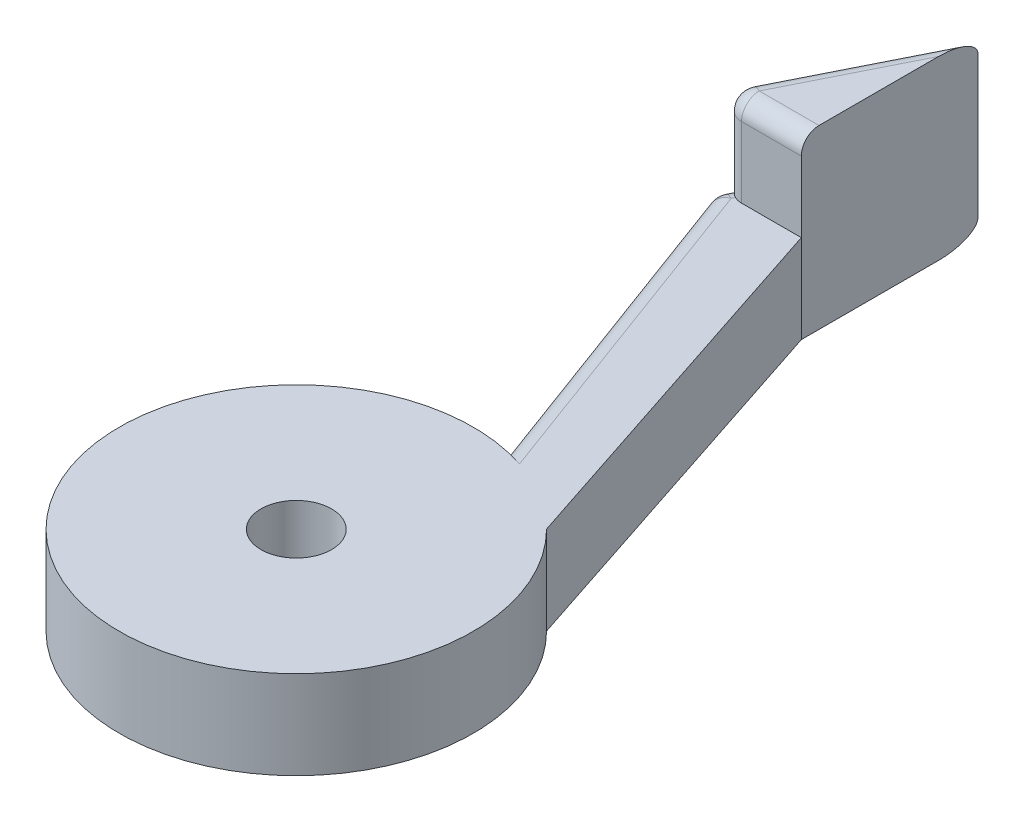
ISO-10303-21;
HEADER;
FILE_DESCRIPTION(('STEP AP214'),'2;1');
FILE_NAME('part.step','',(''),(''),'','','');
FILE_SCHEMA(('AUTOMOTIVE_DESIGN { 1 0 10303 214 1 1 1 1 }'));
ENDSEC;
DATA;
#1=APPLICATION_CONTEXT('core data for automotive mechanical design processes');
#2=APPLICATION_PROTOCOL_DEFINITION('international standard','automotive_design',2000,#1);
#3=PRODUCT_CONTEXT('',#1,'mechanical');
#4=PRODUCT('Part','Part','',(#3));
#5=PRODUCT_RELATED_PRODUCT_CATEGORY('part','',(#4));
#6=PRODUCT_DEFINITION_FORMATION('','',#4);
#7=PRODUCT_DEFINITION_CONTEXT('part definition',#1,'design');
#8=PRODUCT_DEFINITION('design','',#6,#7);
#9=PRODUCT_DEFINITION_SHAPE('','',#8);
#10=(LENGTH_UNIT() NAMED_UNIT(*) SI_UNIT(.MILLI.,.METRE.));
#11=(NAMED_UNIT(*) PLANE_ANGLE_UNIT() SI_UNIT($,.RADIAN.));
#12=(NAMED_UNIT(*) SI_UNIT($,.STERADIAN.) SOLID_ANGLE_UNIT());
#13=UNCERTAINTY_MEASURE_WITH_UNIT(LENGTH_MEASURE(1.E-05),#10,'distance_accuracy_value','');
#14=(GEOMETRIC_REPRESENTATION_CONTEXT(3) GLOBAL_UNCERTAINTY_ASSIGNED_CONTEXT((#13)) GLOBAL_UNIT_ASSIGNED_CONTEXT((#10,
#11,#12)) REPRESENTATION_CONTEXT('',''));
#15=CARTESIAN_POINT('',(0.,0.,0.));
#16=DIRECTION('',(0.,0.,1.));
#17=DIRECTION('',(1.,0.,0.));
#18=AXIS2_PLACEMENT_3D('',#15,#16,#17);
#19=CARTESIAN_POINT('',(-2.19919484502613,2.5,0.813344420387716));
#20=DIRECTION('',(0.937911476638627,0.,-0.346874706471299));
#21=DIRECTION('',(-0.346874706471299,0.,-0.937911476638627));
#22=AXIS2_PLACEMENT_3D('',#19,#20,#21);
#23=PLANE('',#22);
#24=DIRECTION('',(0.346874706471299,0.,0.937911476638627));
#25=VECTOR('',#24,1.);
#26=CARTESIAN_POINT('',(-2.5,2.,0.));
#27=LINE('',#26,#25);
#28=CARTESIAN_POINT('',(0.96874706471299,2.,9.37911476638627));
#29=VERTEX_POINT('',#28);
#30=CARTESIAN_POINT('',(-2.42483672600394,2.,0.203233317354803));
#31=VERTEX_POINT('',#30);
#32=EDGE_CURVE('E201',#29,#31,#27,.F.);
#33=ORIENTED_EDGE('',*,*,#32,.T.);
#34=DIRECTION('',(0.,-1.,0.));
#35=VECTOR('',#34,1.);
#36=CARTESIAN_POINT('',(-2.42483672600394,0.5,0.203233317354803));
#37=LINE('',#36,#35);
#38=CARTESIAN_POINT('',(-2.42483672600394,0.5,0.203233317354803));
#39=VERTEX_POINT('',#38);
#40=EDGE_CURVE('E297',#31,#39,#37,.T.);
#41=ORIENTED_EDGE('',*,*,#40,.T.);
#42=DIRECTION('',(0.346874706471299,0.,0.937911476638627));
#43=VECTOR('',#42,1.);
#44=CARTESIAN_POINT('',(-2.19919484502613,0.5,0.813344420387716));
#45=LINE('',#44,#43);
#46=CARTESIAN_POINT('',(0.96874706471299,0.5,9.37911476638627));
#47=VERTEX_POINT('',#46);
#48=EDGE_CURVE('E199',#39,#47,#45,.T.);
#49=ORIENTED_EDGE('',*,*,#48,.T.);
#50=DIRECTION('',(0.,-1.,0.));
#51=VECTOR('',#50,1.);
#52=CARTESIAN_POINT('',(0.96874706471299,2.5,9.37911476638627));
#53=LINE('',#52,#51);
#54=EDGE_CURVE('E172',#29,#47,#53,.T.);
#55=ORIENTED_EDGE('',*,*,#54,.F.);
#56=EDGE_LOOP('',(#33,#41,#49,#55));
#57=FACE_BOUND('',#56,.T.);
#58=ADVANCED_FACE('F39',(#57),#23,.F.);
#59=CARTESIAN_POINT('',(0.,2.5,14.2927927525466));
#60=DIRECTION('',(0.,-1.,0.));
#61=DIRECTION('',(0.,0.,-1.));
#62=AXIS2_PLACEMENT_3D('',#59,#60,#61);
#63=CYLINDRICAL_SURFACE('',#62,5.00826339433802);
#64=CARTESIAN_POINT('',(0.,0.,14.2927927525466));
#65=DIRECTION('',(0.,1.,0.));
#66=DIRECTION('',(0.,0.,1.));
#67=AXIS2_PLACEMENT_3D('',#64,#65,#66);
#68=CIRCLE('',#67,5.00826339433802);
#69=CARTESIAN_POINT('',(1.55887625665001,0.,9.53331725166213));
#70=VERTEX_POINT('',#69);
#71=CARTESIAN_POINT('',(3.53696271503135,0.,10.7470069468972));
#72=VERTEX_POINT('',#71);
#73=EDGE_CURVE('E331',#70,#72,#68,.T.);
#74=ORIENTED_EDGE('',*,*,#73,.T.);
#75=DIRECTION('',(0.,-1.,0.));
#76=VECTOR('',#75,1.);
#77=CARTESIAN_POINT('',(3.53696271503135,2.5,10.7470069468972));
#78=LINE('',#77,#76);
#79=CARTESIAN_POINT('',(3.53696271503135,2.5,10.7470069468972));
#80=VERTEX_POINT('',#79);
#81=EDGE_CURVE('E170',#80,#72,#78,.T.);
#82=ORIENTED_EDGE('',*,*,#81,.F.);
#83=CARTESIAN_POINT('',(0.,2.5,14.2927927525466));
#84=DIRECTION('',(0.,1.,0.));
#85=DIRECTION('',(0.,0.,1.));
#86=AXIS2_PLACEMENT_3D('',#83,#84,#85);
#87=CIRCLE('',#86,5.00826339433802);
#88=CARTESIAN_POINT('',(1.55887625665001,2.5,9.53331725166213));
#89=VERTEX_POINT('',#88);
#90=EDGE_CURVE('E163',#89,#80,#87,.T.);
#91=ORIENTED_EDGE('',*,*,#90,.F.);
#92=CARTESIAN_POINT('',(1.55887625665001,2.5,9.53331725166213));
#93=CARTESIAN_POINT('',(1.51874915220368,2.50000491035967,9.52014688337141));
#94=CARTESIAN_POINT('',(1.47830324113876,2.49671259069117,9.50748829312047));
#95=CARTESIAN_POINT('',(1.39796524720947,2.48303797539291,9.4834170384644));
#96=CARTESIAN_POINT('',(1.35807865353081,2.47260856343887,9.47201324206123));
#97=CARTESIAN_POINT('',(1.28900253844985,2.44722979943888,9.45314596119411));
#98=CARTESIAN_POINT('',(1.25936554359134,2.43374630756178,9.44536374922276));
#99=CARTESIAN_POINT('',(1.20254098701441,2.40200353236649,9.43095684109237));
#100=CARTESIAN_POINT('',(1.1753461312988,2.38375915262343,9.42432863848792));
#101=CARTESIAN_POINT('',(1.12829992101739,2.34564387241397,9.4132294732132));
#102=CARTESIAN_POINT('',(1.10795914608467,2.32642935430009,9.4085840143167));
#103=CARTESIAN_POINT('',(1.07059323278837,2.28478539561264,9.40025773628084));
#104=CARTESIAN_POINT('',(1.05356920894367,2.26235487875574,9.39657724125255));
#105=CARTESIAN_POINT('',(1.0235709752695,2.21459048504414,9.39021764507806));
#106=CARTESIAN_POINT('',(1.01062252498672,2.18923947186843,9.38754489314206));
#107=CARTESIAN_POINT('',(0.98967847754528,2.13649780798282,9.3832759790104));
#108=CARTESIAN_POINT('',(0.98167405679979,2.10911088922022,9.38167789839861));
#109=CARTESIAN_POINT('',(0.973850202143294,2.06783919494106,9.38012302562548));
#110=CARTESIAN_POINT('',(0.971938972317017,2.05433892817381,9.37974488474474));
#111=CARTESIAN_POINT('',(0.969387665779037,2.02722868792913,9.37924101432628));
#112=CARTESIAN_POINT('',(0.968746244888863,2.01361884579003,9.37911501787512));
#113=CARTESIAN_POINT('',(0.968747064712989,2.,9.37911476638627));
#114=B_SPLINE_CURVE_WITH_KNOTS('',3,(#92,#93,#94,#95,#96,#97,#98,#99,#100,#101,#102,#103,#104,
#105,#106,#107,#108,#109,#110,#111,#112,#113),.UNSPECIFIED.,.F.,.F.,(4,2,2,2,2,2,2,2,2,2,4),(0.,
0.126803701271093,0.254452691142103,0.354487672778958,0.454213183214775,0.538953117732193,
0.623721478253533,0.709015328927398,0.794156512859183,0.835023142166766,0.875846488207517),.UNSPECIFIED.);
#115=EDGE_CURVE('E204',#89,#29,#114,.T.);
#116=ORIENTED_EDGE('',*,*,#115,.T.);
#117=ORIENTED_EDGE('',*,*,#54,.T.);
#118=CARTESIAN_POINT('',(0.96874706471299,0.5,9.37911476638627));
#119=CARTESIAN_POINT('',(0.968710230051385,0.474989795484606,9.37911305088923));
#120=CARTESIAN_POINT('',(0.970902466561813,0.4500056432001,9.37953970679768));
#121=CARTESIAN_POINT('',(0.979450683810274,0.400891966710027,9.38123377058047));
#122=CARTESIAN_POINT('',(0.985789401633862,0.376759334508423,9.38249769296485));
#123=CARTESIAN_POINT('',(1.00233468237207,0.329949241123511,9.38584932354842));
#124=CARTESIAN_POINT('',(1.01253851631272,0.30727076640842,9.38793645056492));
#125=CARTESIAN_POINT('',(1.03634822116773,0.263866074714385,9.39291182854659));
#126=CARTESIAN_POINT('',(1.04995650799676,0.243141258558408,9.39580064857997));
#127=CARTESIAN_POINT('',(1.08074272126823,0.203119149009627,9.40250075348891));
#128=CARTESIAN_POINT('',(1.09805800338941,0.183934205625374,9.40634891146972));
#129=CARTESIAN_POINT('',(1.13519202069972,0.1483840522186,9.41484192531756));
#130=CARTESIAN_POINT('',(1.15501151226218,0.132019697674217,9.41948702204491));
#131=CARTESIAN_POINT('',(1.1993710849182,0.100199436689002,9.43020101601807));
#132=CARTESIAN_POINT('',(1.22418710505081,0.0851655054017718,9.43637750407447));
#133=CARTESIAN_POINT('',(1.27552126387592,0.0588537159718972,9.44960661843922));
#134=CARTESIAN_POINT('',(1.30204086315974,0.0475791336438873,9.45666000154677));
#135=CARTESIAN_POINT('',(1.36087613424571,0.0270272084467275,9.47285457721357));
#136=CARTESIAN_POINT('',(1.39339304181379,0.018446222966681,9.48214502639475));
#137=CARTESIAN_POINT('',(1.45901410798038,0.00608366000536986,9.50163948291999));
#138=CARTESIAN_POINT('',(1.49211774445138,0.0022980131690161,9.5118427077929));
#139=CARTESIAN_POINT('',(1.53642244372996,0.000256629342131228,9.52600657570718));
#140=CARTESIAN_POINT('',(1.54765844067295,1.59562613622878E-07,9.52964252599592));
#141=CARTESIAN_POINT('',(1.55887625665001,0.,9.53331725166213));
#142=B_SPLINE_CURVE_WITH_KNOTS('',3,(#118,#119,#120,#121,#122,#123,#124,#125,#126,#127,#128,
#129,#130,#131,#132,#133,#134,#135,#136,#137,#138,#139,#140,#141),.UNSPECIFIED.,.F.,.F.,(4,2,2,
2,2,2,2,2,2,2,2,4),(0.,0.0748902378983276,0.149470655151911,0.22399851258989,0.298579408278331,
0.376654002826512,0.454752235710567,0.543409763768,0.632144345391368,0.736430704440913,
0.84062850600088,0.876051836267374),.UNSPECIFIED.);
#143=EDGE_CURVE('E212',#47,#70,#142,.T.);
#144=ORIENTED_EDGE('',*,*,#143,.T.);
#145=EDGE_LOOP('',(#74,#82,#91,#116,#117,#144));
#146=FACE_BOUND('',#145,.T.);
#147=ADVANCED_FACE('F219',(#146),#63,.T.);
#148=CARTESIAN_POINT('',(0.,2.5,0.));
#149=DIRECTION('',(0.949879525014784,0.,-0.312616199128722));
#150=DIRECTION('',(-0.312616199128722,0.,-0.949879525014784));
#151=AXIS2_PLACEMENT_3D('',#148,#149,#150);
#152=PLANE('',#151);
#153=DIRECTION('',(0.312616199128722,0.,0.949879525014784));
#154=VECTOR('',#153,1.);
#155=CARTESIAN_POINT('',(0.,0.,0.));
#156=LINE('',#155,#154);
#157=CARTESIAN_POINT('',(0.,0.,0.));
#158=VERTEX_POINT('',#157);
#159=EDGE_CURVE('E169',#158,#72,#156,.T.);
#160=ORIENTED_EDGE('',*,*,#159,.F.);
#161=DIRECTION('',(0.,-1.,0.));
#162=VECTOR('',#161,1.);
#163=CARTESIAN_POINT('',(0.,2.5,0.));
#164=LINE('',#163,#162);
#165=CARTESIAN_POINT('',(0.,2.5,0.));
#166=VERTEX_POINT('',#165);
#167=EDGE_CURVE('E146',#166,#158,#164,.T.);
#168=ORIENTED_EDGE('',*,*,#167,.F.);
#169=DIRECTION('',(0.312616199128722,0.,0.949879525014784));
#170=VECTOR('',#169,1.);
#171=CARTESIAN_POINT('',(0.,2.5,0.));
#172=LINE('',#171,#170);
#173=EDGE_CURVE('E147',#166,#80,#172,.T.);
#174=ORIENTED_EDGE('',*,*,#173,.T.);
#175=ORIENTED_EDGE('',*,*,#81,.T.);
#176=EDGE_LOOP('',(#160,#168,#174,#175));
#177=FACE_BOUND('',#176,.T.);
#178=ADVANCED_FACE('F167',(#177),#152,.T.);
#179=CARTESIAN_POINT('',(0.,2.5,14.2927927525466));
#180=DIRECTION('',(0.,-1.,0.));
#181=DIRECTION('',(0.,0.,-1.));
#182=AXIS2_PLACEMENT_3D('',#179,#180,#181);
#183=CYLINDRICAL_SURFACE('',#182,1.);
#184=CARTESIAN_POINT('',(0.,2.5,14.2927927525466));
#185=DIRECTION('',(0.,1.,0.));
#186=DIRECTION('',(0.,0.,1.));
#187=AXIS2_PLACEMENT_3D('',#184,#185,#186);
#188=CIRCLE('',#187,1.);
#189=CARTESIAN_POINT('',(0.,2.5,15.2927927525466));
#190=VERTEX_POINT('',#189);
#191=EDGE_CURVE('E326',#190,#190,#188,.T.);
#192=ORIENTED_EDGE('',*,*,#191,.T.);
#193=EDGE_LOOP('',(#192));
#194=FACE_BOUND('',#193,.T.);
#195=CARTESIAN_POINT('',(0.,0.,14.2927927525466));
#196=DIRECTION('',(0.,1.,0.));
#197=DIRECTION('',(0.,0.,1.));
#198=AXIS2_PLACEMENT_3D('',#195,#196,#197);
#199=CIRCLE('',#198,1.);
#200=CARTESIAN_POINT('',(0.,0.,15.2927927525466));
#201=VERTEX_POINT('',#200);
#202=EDGE_CURVE('E157',#201,#201,#199,.T.);
#203=ORIENTED_EDGE('',*,*,#202,.F.);
#204=EDGE_LOOP('',(#203));
#205=FACE_BOUND('',#204,.T.);
#206=ADVANCED_FACE('F265',(#194,#205),#183,.F.);
#207=CARTESIAN_POINT('',(0.,2.5,0.));
#208=DIRECTION('',(0.,1.,0.));
#209=DIRECTION('',(0.,0.,1.));
#210=AXIS2_PLACEMENT_3D('',#207,#208,#209);
#211=PLANE('',#210);
#212=ORIENTED_EDGE('',*,*,#191,.F.);
#213=EDGE_LOOP('',(#212));
#214=FACE_BOUND('',#213,.T.);
#215=DIRECTION('',(1.,0.,0.));
#216=VECTOR('',#215,1.);
#217=CARTESIAN_POINT('',(0.,2.5,0.));
#218=LINE('',#217,#216);
#219=CARTESIAN_POINT('',(-1.69098300562505,2.5,0.));
#220=VERTEX_POINT('',#219);
#221=EDGE_CURVE('E136',#220,#166,#218,.T.);
#222=ORIENTED_EDGE('',*,*,#221,.F.);
#223=CARTESIAN_POINT('',(-1.69098300562505,2.5,-0.5));
#224=DIRECTION('',(0.,1.,0.));
#225=DIRECTION('',(0.,0.,1.));
#226=AXIS2_PLACEMENT_3D('',#223,#224,#225);
#227=CIRCLE('',#226,0.5);
#228=CARTESIAN_POINT('',(-1.91458980337503,2.5,-0.0527864045000418));
#229=VERTEX_POINT('',#228);
#230=EDGE_CURVE('E11',#220,#229,#227,.F.);
#231=ORIENTED_EDGE('',*,*,#230,.T.);
#232=DIRECTION('',(-0.447213595499958,0.,0.894427190999916));
#233=VECTOR('',#232,1.);
#234=CARTESIAN_POINT('',(-1.55278640450004,2.5,-0.776393202250021));
#235=LINE('',#234,#233);
#236=CARTESIAN_POINT('',(-1.95588098768463,2.5,0.0297959641191552));
#237=VERTEX_POINT('',#236);
#238=EDGE_CURVE('E56',#229,#237,#235,.T.);
#239=ORIENTED_EDGE('',*,*,#238,.T.);
#240=DIRECTION('',(0.346874706471299,0.,0.937911476638627));
#241=VECTOR('',#240,1.);
#242=CARTESIAN_POINT('',(1.4377028030323,2.5,9.20567741315062));
#243=LINE('',#242,#241);
#244=EDGE_CURVE('E197',#237,#89,#243,.T.);
#245=ORIENTED_EDGE('',*,*,#244,.T.);
#246=ORIENTED_EDGE('',*,*,#90,.T.);
#247=ORIENTED_EDGE('',*,*,#173,.F.);
#248=EDGE_LOOP('',(#222,#231,#239,#245,#246,#247));
#249=FACE_BOUND('',#248,.T.);
#250=ADVANCED_FACE('F161',(#214,#249),#211,.T.);
#251=CARTESIAN_POINT('',(0.,0.,0.));
#252=DIRECTION('',(0.,1.,0.));
#253=DIRECTION('',(0.,0.,1.));
#254=AXIS2_PLACEMENT_3D('',#251,#252,#253);
#255=PLANE('',#254);
#256=ORIENTED_EDGE('',*,*,#202,.T.);
#257=EDGE_LOOP('',(#256));
#258=FACE_BOUND('',#257,.T.);
#259=DIRECTION('',(0.346874706471299,0.,0.937911476638627));
#260=VECTOR('',#259,1.);
#261=CARTESIAN_POINT('',(-1.73023910670681,0.,0.639907067152066));
#262=LINE('',#261,#260);
#263=CARTESIAN_POINT('',(-1.95588098768463,0.,0.0297959641191532));
#264=VERTEX_POINT('',#263);
#265=EDGE_CURVE('E191',#70,#264,#262,.F.);
#266=ORIENTED_EDGE('',*,*,#265,.T.);
#267=DIRECTION('',(0.447213595499958,0.,-0.894427190999916));
#268=VECTOR('',#267,1.);
#269=CARTESIAN_POINT('',(0.447213595499958,0.,-4.77639320225002));
#270=LINE('',#269,#268);
#271=CARTESIAN_POINT('',(0.,0.,-3.8819660112501));
#272=VERTEX_POINT('',#271);
#273=EDGE_CURVE('E194',#264,#272,#270,.T.);
#274=ORIENTED_EDGE('',*,*,#273,.T.);
#275=DIRECTION('',(0.,0.,-1.));
#276=VECTOR('',#275,1.);
#277=CARTESIAN_POINT('',(0.,0.,0.));
#278=LINE('',#277,#276);
#279=EDGE_CURVE('E318',#158,#272,#278,.T.);
#280=ORIENTED_EDGE('',*,*,#279,.F.);
#281=ORIENTED_EDGE('',*,*,#159,.T.);
#282=ORIENTED_EDGE('',*,*,#73,.F.);
#283=EDGE_LOOP('',(#266,#274,#280,#281,#282));
#284=FACE_BOUND('',#283,.T.);
#285=ADVANCED_FACE('F334',(#258,#284),#255,.F.);
#286=CARTESIAN_POINT('',(0.,5.,0.));
#287=DIRECTION('',(0.,0.,-1.));
#288=DIRECTION('',(-1.,0.,0.));
#289=AXIS2_PLACEMENT_3D('',#286,#287,#288);
#290=PLANE('',#289);
#291=DIRECTION('',(0.,-1.,0.));
#292=VECTOR('',#291,1.);
#293=CARTESIAN_POINT('',(0.,5.,0.));
#294=LINE('',#293,#292);
#295=CARTESIAN_POINT('',(0.,4.5,0.));
#296=VERTEX_POINT('',#295);
#297=EDGE_CURVE('E139',#296,#166,#294,.T.);
#298=ORIENTED_EDGE('',*,*,#297,.F.);
#299=DIRECTION('',(1.,0.,0.));
#300=VECTOR('',#299,1.);
#301=CARTESIAN_POINT('',(-1.94098300562505,4.5,0.));
#302=LINE('',#301,#300);
#303=CARTESIAN_POINT('',(-1.69098300562505,4.5,0.));
#304=VERTEX_POINT('',#303);
#305=EDGE_CURVE('E290',#296,#304,#302,.F.);
#306=ORIENTED_EDGE('',*,*,#305,.T.);
#307=DIRECTION('',(0.,-1.,0.));
#308=VECTOR('',#307,1.);
#309=CARTESIAN_POINT('',(-1.69098300562505,2.,0.));
#310=LINE('',#309,#308);
#311=EDGE_CURVE('E142',#304,#220,#310,.T.);
#312=ORIENTED_EDGE('',*,*,#311,.T.);
#313=ORIENTED_EDGE('',*,*,#221,.T.);
#314=EDGE_LOOP('',(#298,#306,#312,#313));
#315=FACE_BOUND('',#314,.T.);
#316=ADVANCED_FACE('F138',(#315),#290,.F.);
#317=CARTESIAN_POINT('',(-2.,5.,-1.));
#318=DIRECTION('',(-0.894427190999916,0.,-0.447213595499958));
#319=DIRECTION('',(-0.447213595499958,0.,0.894427190999916));
#320=AXIS2_PLACEMENT_3D('',#317,#318,#319);
#321=PLANE('',#320);
#322=DIRECTION('',(0.447213595499958,0.,-0.894427190999916));
#323=VECTOR('',#322,1.);
#324=CARTESIAN_POINT('',(-2.5,0.5,0.));
#325=LINE('',#324,#323);
#326=CARTESIAN_POINT('',(0.,0.5,-5.));
#327=VERTEX_POINT('',#326);
#328=CARTESIAN_POINT('',(-2.40309458318459,0.5,-0.193810833630826));
#329=VERTEX_POINT('',#328);
#330=EDGE_CURVE('E179',#327,#329,#325,.F.);
#331=ORIENTED_EDGE('',*,*,#330,.T.);
#332=DIRECTION('',(0.,-1.,0.));
#333=VECTOR('',#332,1.);
#334=CARTESIAN_POINT('',(-2.40309458318459,2.,-0.193810833630826));
#335=LINE('',#334,#333);
#336=CARTESIAN_POINT('',(-2.40309458318459,2.,-0.193810833630826));
#337=VERTEX_POINT('',#336);
#338=EDGE_CURVE('E48',#329,#337,#335,.F.);
#339=ORIENTED_EDGE('',*,*,#338,.T.);
#340=DIRECTION('',(-0.447213595499958,0.,0.894427190999916));
#341=VECTOR('',#340,1.);
#342=CARTESIAN_POINT('',(-2.,2.,-1.));
#343=LINE('',#342,#341);
#344=CARTESIAN_POINT('',(-2.13819660112501,2.,-0.723606797749979));
#345=VERTEX_POINT('',#344);
#346=EDGE_CURVE('E301',#337,#345,#343,.F.);
#347=ORIENTED_EDGE('',*,*,#346,.T.);
#348=DIRECTION('',(0.,-1.,0.));
#349=VECTOR('',#348,1.);
#350=CARTESIAN_POINT('',(-2.13819660112501,4.5,-0.723606797749979));
#351=LINE('',#350,#349);
#352=CARTESIAN_POINT('',(-2.13819660112501,4.5,-0.723606797749979));
#353=VERTEX_POINT('',#352);
#354=EDGE_CURVE('E299',#345,#353,#351,.F.);
#355=ORIENTED_EDGE('',*,*,#354,.T.);
#356=DIRECTION('',(0.447213595499958,0.,-0.894427190999916));
#357=VECTOR('',#356,1.);
#358=CARTESIAN_POINT('',(-2.,4.5,-1.));
#359=LINE('',#358,#357);
#360=CARTESIAN_POINT('',(0.,4.5,-5.));
#361=VERTEX_POINT('',#360);
#362=EDGE_CURVE('E181',#353,#361,#359,.T.);
#363=ORIENTED_EDGE('',*,*,#362,.T.);
#364=DIRECTION('',(0.,-1.,0.));
#365=VECTOR('',#364,1.);
#366=CARTESIAN_POINT('',(0.,5.,-5.));
#367=LINE('',#366,#365);
#368=EDGE_CURVE('E158',#361,#327,#367,.T.);
#369=ORIENTED_EDGE('',*,*,#368,.T.);
#370=EDGE_LOOP('',(#331,#339,#347,#355,#363,#369));
#371=FACE_BOUND('',#370,.T.);
#372=ADVANCED_FACE('F343',(#371),#321,.T.);
#373=CARTESIAN_POINT('',(0.,5.,0.));
#374=DIRECTION('',(-1.,0.,0.));
#375=DIRECTION('',(0.,0.,1.));
#376=AXIS2_PLACEMENT_3D('',#373,#374,#375);
#377=PLANE('',#376);
#378=DIRECTION('',(0.,0.,-1.));
#379=VECTOR('',#378,1.);
#380=CARTESIAN_POINT('',(0.,5.,0.));
#381=LINE('',#380,#379);
#382=CARTESIAN_POINT('',(0.,5.,-0.5));
#383=VERTEX_POINT('',#382);
#384=CARTESIAN_POINT('',(0.,5.,-3.88196601125011));
#385=VERTEX_POINT('',#384);
#386=EDGE_CURVE('E320',#383,#385,#381,.T.);
#387=ORIENTED_EDGE('',*,*,#386,.F.);
#388=CARTESIAN_POINT('',(0.,4.5,-0.5));
#389=DIRECTION('',(-1.,0.,0.));
#390=DIRECTION('',(0.,0.,1.));
#391=AXIS2_PLACEMENT_3D('',#388,#389,#390);
#392=CIRCLE('',#391,0.5);
#393=EDGE_CURVE('E156',#383,#296,#392,.F.);
#394=ORIENTED_EDGE('',*,*,#393,.T.);
#395=ORIENTED_EDGE('',*,*,#297,.T.);
#396=ORIENTED_EDGE('',*,*,#167,.T.);
#397=ORIENTED_EDGE('',*,*,#279,.T.);
#398=CARTESIAN_POINT('',(0.,0.5,-3.8819660112501));
#399=DIRECTION('',(-1.,0.,0.));
#400=DIRECTION('',(0.,0.,1.));
#401=AXIS2_PLACEMENT_3D('',#398,#399,#400);
#402=ELLIPSE('',#401,1.11803398874989,0.5);
#403=EDGE_CURVE('E183',#272,#327,#402,.F.);
#404=ORIENTED_EDGE('',*,*,#403,.T.);
#405=ORIENTED_EDGE('',*,*,#368,.F.);
#406=CARTESIAN_POINT('',(0.,4.5,-3.88196601125011));
#407=DIRECTION('',(-1.,0.,0.));
#408=DIRECTION('',(0.,0.,-1.));
#409=AXIS2_PLACEMENT_3D('',#406,#407,#408);
#410=ELLIPSE('',#409,1.11803398874989,0.5);
#411=EDGE_CURVE('E185',#361,#385,#410,.F.);
#412=ORIENTED_EDGE('',*,*,#411,.T.);
#413=EDGE_LOOP('',(#387,#394,#395,#396,#397,#404,#405,#412));
#414=FACE_BOUND('',#413,.T.);
#415=ADVANCED_FACE('F152',(#414),#377,.F.);
#416=CARTESIAN_POINT('',(0.,5.,0.));
#417=DIRECTION('',(0.,1.,0.));
#418=DIRECTION('',(0.,0.,1.));
#419=AXIS2_PLACEMENT_3D('',#416,#417,#418);
#420=PLANE('',#419);
#421=DIRECTION('',(0.447213595499958,0.,-0.894427190999916));
#422=VECTOR('',#421,1.);
#423=CARTESIAN_POINT('',(-1.55278640450004,5.,-0.776393202250021));
#424=LINE('',#423,#422);
#425=CARTESIAN_POINT('',(-1.69098300562505,5.,-0.5));
#426=VERTEX_POINT('',#425);
#427=EDGE_CURVE('E188',#385,#426,#424,.F.);
#428=ORIENTED_EDGE('',*,*,#427,.T.);
#429=DIRECTION('',(1.,0.,0.));
#430=VECTOR('',#429,1.);
#431=CARTESIAN_POINT('',(0.,5.,-0.5));
#432=LINE('',#431,#430);
#433=EDGE_CURVE('E339',#426,#383,#432,.T.);
#434=ORIENTED_EDGE('',*,*,#433,.T.);
#435=ORIENTED_EDGE('',*,*,#386,.T.);
#436=EDGE_LOOP('',(#428,#434,#435));
#437=FACE_BOUND('',#436,.T.);
#438=ADVANCED_FACE('F271',(#437),#420,.T.);
#439=CARTESIAN_POINT('',(-1.55278640450004,4.5,-0.776393202250021));
#440=DIRECTION('',(0.447213595499958,0.,-0.894427190999916));
#441=DIRECTION('',(-0.894427190999916,0.,-0.447213595499958));
#442=AXIS2_PLACEMENT_3D('',#439,#440,#441);
#443=CYLINDRICAL_SURFACE('',#442,0.5);
#444=ORIENTED_EDGE('',*,*,#362,.F.);
#445=CARTESIAN_POINT('',(-1.69098300562505,4.5,-0.5));
#446=DIRECTION('',(0.447213595499958,0.,-0.894427190999916));
#447=DIRECTION('',(-0.894427190999916,0.,-0.447213595499958));
#448=AXIS2_PLACEMENT_3D('',#445,#446,#447);
#449=CIRCLE('',#448,0.5);
#450=EDGE_CURVE('E287',#353,#426,#449,.T.);
#451=ORIENTED_EDGE('',*,*,#450,.T.);
#452=ORIENTED_EDGE('',*,*,#427,.F.);
#453=ORIENTED_EDGE('',*,*,#411,.F.);
#454=EDGE_LOOP('',(#444,#451,#452,#453));
#455=FACE_BOUND('',#454,.T.);
#456=ADVANCED_FACE('F269',(#455),#443,.T.);
#457=CARTESIAN_POINT('',(-1.73023910670681,0.5,0.639907067152066));
#458=DIRECTION('',(0.346874706471299,0.,0.937911476638627));
#459=DIRECTION('',(0.937911476638627,0.,-0.346874706471299));
#460=AXIS2_PLACEMENT_3D('',#457,#458,#459);
#461=CYLINDRICAL_SURFACE('',#460,0.5);
#462=ORIENTED_EDGE('',*,*,#48,.F.);
#463=CARTESIAN_POINT('',(-1.95588098768463,0.5,0.0297959641191534));
#464=DIRECTION('',(0.346874706471299,0.,0.937911476638627));
#465=DIRECTION('',(0.937911476638627,0.,-0.346874706471299));
#466=AXIS2_PLACEMENT_3D('',#463,#464,#465);
#467=CIRCLE('',#466,0.5);
#468=EDGE_CURVE('E286',#39,#264,#467,.T.);
#469=ORIENTED_EDGE('',*,*,#468,.T.);
#470=ORIENTED_EDGE('',*,*,#265,.F.);
#471=ORIENTED_EDGE('',*,*,#143,.F.);
#472=EDGE_LOOP('',(#462,#469,#470,#471));
#473=FACE_BOUND('',#472,.T.);
#474=ADVANCED_FACE('F229',(#473),#461,.T.);
#475=CARTESIAN_POINT('',(-1.55278640450004,0.5,-0.776393202250021));
#476=DIRECTION('',(-0.447213595499958,0.,0.894427190999916));
#477=DIRECTION('',(0.894427190999916,0.,0.447213595499958));
#478=AXIS2_PLACEMENT_3D('',#475,#476,#477);
#479=CYLINDRICAL_SURFACE('',#478,0.5);
#480=ORIENTED_EDGE('',*,*,#273,.F.);
#481=CARTESIAN_POINT('',(-1.95588098768463,0.5,0.0297959641191533));
#482=DIRECTION('',(-0.447213595499958,0.,0.894427190999916));
#483=DIRECTION('',(0.894427190999916,0.,0.447213595499958));
#484=AXIS2_PLACEMENT_3D('',#481,#482,#483);
#485=CIRCLE('',#484,0.5);
#486=EDGE_CURVE('E282',#264,#329,#485,.F.);
#487=ORIENTED_EDGE('',*,*,#486,.T.);
#488=ORIENTED_EDGE('',*,*,#330,.F.);
#489=ORIENTED_EDGE('',*,*,#403,.F.);
#490=EDGE_LOOP('',(#480,#487,#488,#489));
#491=FACE_BOUND('',#490,.T.);
#492=ADVANCED_FACE('F227',(#491),#479,.T.);
#493=CARTESIAN_POINT('',(-1.73023910670681,2.,0.639907067152066));
#494=DIRECTION('',(-0.346874706471299,0.,-0.937911476638627));
#495=DIRECTION('',(-0.937911476638627,0.,0.346874706471299));
#496=AXIS2_PLACEMENT_3D('',#493,#494,#495);
#497=CYLINDRICAL_SURFACE('',#496,0.5);
#498=ORIENTED_EDGE('',*,*,#244,.F.);
#499=CARTESIAN_POINT('',(-1.95588098768463,2.,0.0297959641191531));
#500=DIRECTION('',(-0.346874706471299,0.,-0.937911476638627));
#501=DIRECTION('',(-0.937911476638627,0.,0.346874706471299));
#502=AXIS2_PLACEMENT_3D('',#499,#500,#501);
#503=CIRCLE('',#502,0.5);
#504=EDGE_CURVE('E295',#237,#31,#503,.F.);
#505=ORIENTED_EDGE('',*,*,#504,.T.);
#506=ORIENTED_EDGE('',*,*,#32,.F.);
#507=ORIENTED_EDGE('',*,*,#115,.F.);
#508=EDGE_LOOP('',(#498,#505,#506,#507));
#509=FACE_BOUND('',#508,.T.);
#510=ADVANCED_FACE('F223',(#509),#497,.T.);
#511=CARTESIAN_POINT('',(-1.95588098768463,0.5,0.0297959641191534));
#512=DIRECTION('',(0.,0.,1.));
#513=DIRECTION('',(1.,0.,0.));
#514=AXIS2_PLACEMENT_3D('',#511,#512,#513);
#515=SPHERICAL_SURFACE('',#514,0.5);
#516=ORIENTED_EDGE('',*,*,#486,.F.);
#517=ORIENTED_EDGE('',*,*,#468,.F.);
#518=CARTESIAN_POINT('',(-1.95588098768463,0.5,0.0297959641191535));
#519=DIRECTION('',(0.,1.,0.));
#520=DIRECTION('',(0.,0.,1.));
#521=AXIS2_PLACEMENT_3D('',#518,#519,#520);
#522=CIRCLE('',#521,0.5);
#523=EDGE_CURVE('E43',#329,#39,#522,.T.);
#524=ORIENTED_EDGE('',*,*,#523,.F.);
#525=EDGE_LOOP('',(#516,#517,#524));
#526=FACE_BOUND('',#525,.T.);
#527=ADVANCED_FACE('F41',(#526),#515,.T.);
#528=CARTESIAN_POINT('',(-1.95588098768463,2.5,0.0297959641191534));
#529=DIRECTION('',(0.,1.,0.));
#530=DIRECTION('',(0.,0.,1.));
#531=AXIS2_PLACEMENT_3D('',#528,#529,#530);
#532=CYLINDRICAL_SURFACE('',#531,0.5);
#533=ORIENTED_EDGE('',*,*,#523,.T.);
#534=ORIENTED_EDGE('',*,*,#40,.F.);
#535=CARTESIAN_POINT('',(-1.95588098768463,2.,0.0297959641191532));
#536=DIRECTION('',(0.,1.,0.));
#537=DIRECTION('',(0.,0.,1.));
#538=AXIS2_PLACEMENT_3D('',#535,#536,#537);
#539=CIRCLE('',#538,0.5);
#540=EDGE_CURVE('E314',#337,#31,#539,.T.);
#541=ORIENTED_EDGE('',*,*,#540,.F.);
#542=ORIENTED_EDGE('',*,*,#338,.F.);
#543=EDGE_LOOP('',(#533,#534,#541,#542));
#544=FACE_BOUND('',#543,.T.);
#545=ADVANCED_FACE('F249',(#544),#532,.T.);
#546=CARTESIAN_POINT('',(-1.95588098768463,2.,0.0297959641191531));
#547=DIRECTION('',(-0.894427190999916,0.,-0.447213595499958));
#548=DIRECTION('',(-0.447213595499958,0.,0.894427190999916));
#549=AXIS2_PLACEMENT_3D('',#546,#547,#548);
#550=SPHERICAL_SURFACE('',#549,0.5);
#551=ORIENTED_EDGE('',*,*,#540,.T.);
#552=ORIENTED_EDGE('',*,*,#504,.F.);
#553=CARTESIAN_POINT('',(-1.95588098768463,2.,0.0297959641191531));
#554=DIRECTION('',(0.447213595499958,0.,-0.894427190999916));
#555=DIRECTION('',(-0.894427190999916,0.,-0.447213595499958));
#556=AXIS2_PLACEMENT_3D('',#553,#554,#555);
#557=CIRCLE('',#556,0.5);
#558=EDGE_CURVE('E313',#337,#237,#557,.T.);
#559=ORIENTED_EDGE('',*,*,#558,.F.);
#560=EDGE_LOOP('',(#551,#552,#559));
#561=FACE_BOUND('',#560,.T.);
#562=ADVANCED_FACE('F247',(#561),#550,.T.);
#563=CARTESIAN_POINT('',(-1.55278640450004,2.,-0.776393202250021));
#564=DIRECTION('',(-0.447213595499958,0.,0.894427190999916));
#565=DIRECTION('',(0.894427190999916,0.,0.447213595499958));
#566=AXIS2_PLACEMENT_3D('',#563,#564,#565);
#567=CYLINDRICAL_SURFACE('',#566,0.5);
#568=ORIENTED_EDGE('',*,*,#238,.F.);
#569=CARTESIAN_POINT('',(-1.69098300562505,2.,-0.5));
#570=DIRECTION('',(-0.316227766016838,-0.707106781186547,0.632455532033676));
#571=DIRECTION('',(-0.316227766016838,0.707106781186547,0.632455532033676));
#572=AXIS2_PLACEMENT_3D('',#569,#570,#571);
#573=ELLIPSE('',#572,0.707106781186547,0.5);
#574=EDGE_CURVE('E310',#345,#229,#573,.F.);
#575=ORIENTED_EDGE('',*,*,#574,.F.);
#576=ORIENTED_EDGE('',*,*,#346,.F.);
#577=ORIENTED_EDGE('',*,*,#558,.T.);
#578=EDGE_LOOP('',(#568,#575,#576,#577));
#579=FACE_BOUND('',#578,.T.);
#580=ADVANCED_FACE('F243',(#579),#567,.T.);
#581=CARTESIAN_POINT('',(-1.69098300562505,5.,-0.5));
#582=DIRECTION('',(0.,1.,0.));
#583=DIRECTION('',(0.,0.,1.));
#584=AXIS2_PLACEMENT_3D('',#581,#582,#583);
#585=CYLINDRICAL_SURFACE('',#584,0.5);
#586=CARTESIAN_POINT('',(-1.69098300562505,4.5,-0.5));
#587=DIRECTION('',(0.,1.,0.));
#588=DIRECTION('',(0.,0.,1.));
#589=AXIS2_PLACEMENT_3D('',#586,#587,#588);
#590=CIRCLE('',#589,0.5);
#591=EDGE_CURVE('E307',#353,#304,#590,.T.);
#592=ORIENTED_EDGE('',*,*,#591,.F.);
#593=ORIENTED_EDGE('',*,*,#354,.F.);
#594=ORIENTED_EDGE('',*,*,#574,.T.);
#595=ORIENTED_EDGE('',*,*,#230,.F.);
#596=ORIENTED_EDGE('',*,*,#311,.F.);
#597=EDGE_LOOP('',(#592,#593,#594,#595,#596));
#598=FACE_BOUND('',#597,.T.);
#599=ADVANCED_FACE('F239',(#598),#585,.T.);
#600=CARTESIAN_POINT('',(-1.69098300562505,4.5,-0.5));
#601=DIRECTION('',(0.,0.,-1.));
#602=DIRECTION('',(-1.,0.,0.));
#603=AXIS2_PLACEMENT_3D('',#600,#601,#602);
#604=SPHERICAL_SURFACE('',#603,0.5);
#605=ORIENTED_EDGE('',*,*,#450,.F.);
#606=ORIENTED_EDGE('',*,*,#591,.T.);
#607=CARTESIAN_POINT('',(-1.69098300562505,4.5,-0.5));
#608=DIRECTION('',(1.,0.,0.));
#609=DIRECTION('',(0.,0.,-1.));
#610=AXIS2_PLACEMENT_3D('',#607,#608,#609);
#611=CIRCLE('',#610,0.5);
#612=EDGE_CURVE('E304',#426,#304,#611,.T.);
#613=ORIENTED_EDGE('',*,*,#612,.F.);
#614=EDGE_LOOP('',(#605,#606,#613));
#615=FACE_BOUND('',#614,.T.);
#616=ADVANCED_FACE('F235',(#615),#604,.T.);
#617=CARTESIAN_POINT('',(0.,4.5,-0.5));
#618=DIRECTION('',(-1.,0.,0.));
#619=DIRECTION('',(0.,0.,1.));
#620=AXIS2_PLACEMENT_3D('',#617,#618,#619);
#621=CYLINDRICAL_SURFACE('',#620,0.5);
#622=ORIENTED_EDGE('',*,*,#612,.T.);
#623=ORIENTED_EDGE('',*,*,#305,.F.);
#624=ORIENTED_EDGE('',*,*,#393,.F.);
#625=ORIENTED_EDGE('',*,*,#433,.F.);
#626=EDGE_LOOP('',(#622,#623,#624,#625));
#627=FACE_BOUND('',#626,.T.);
#628=ADVANCED_FACE('F232',(#627),#621,.T.);
#629=CLOSED_SHELL('',(#58,#147,#178,#206,#250,#285,#316,#372,#415,#438,#456,#474,#492,#510,#527,
#545,#562,#580,#599,#616,#628));
#630=MANIFOLD_SOLID_BREP('B2',#629);
#631=ADVANCED_BREP_SHAPE_REPRESENTATION('',(#18,#630),#14);
#632=SHAPE_DEFINITION_REPRESENTATION(#9,#631);
ENDSEC;
END-ISO-10303-21;
